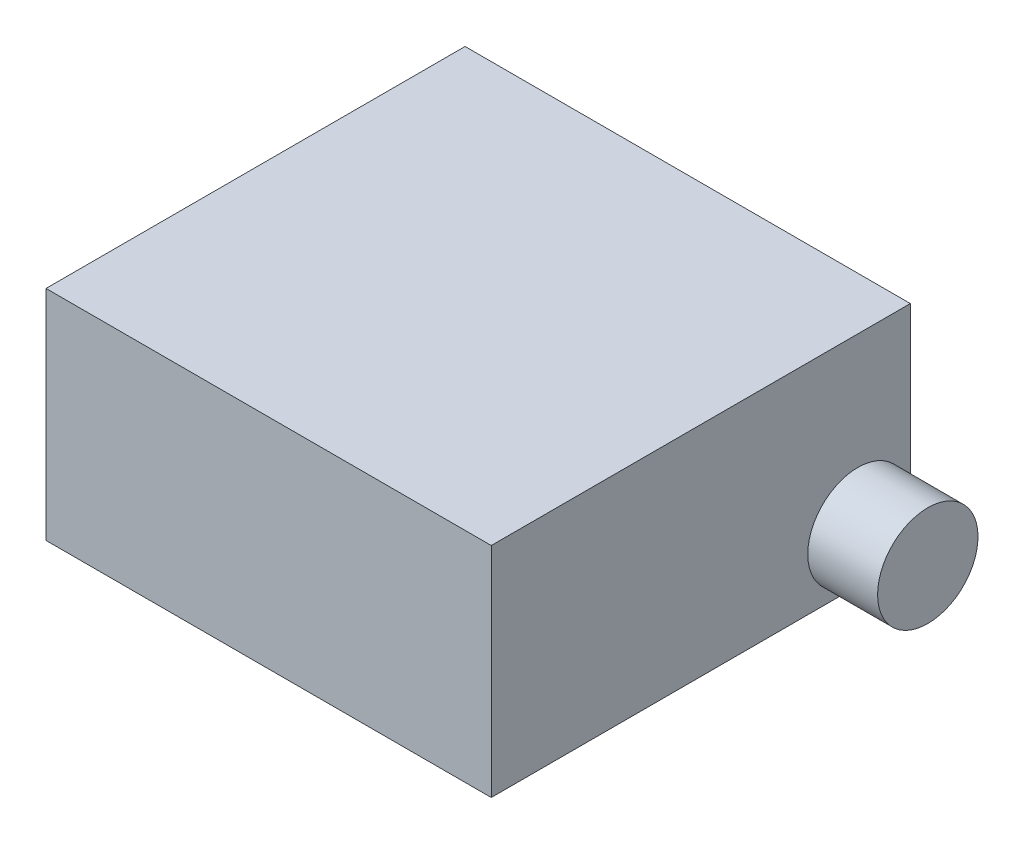
ISO-10303-21;
HEADER;
FILE_DESCRIPTION(('STEP AP214'),'2;1');
FILE_NAME('part.step','',(''),(''),'','','');
FILE_SCHEMA(('AUTOMOTIVE_DESIGN { 1 0 10303 214 1 1 1 1 }'));
ENDSEC;
DATA;
#1=APPLICATION_CONTEXT('core data for automotive mechanical design processes');
#2=APPLICATION_PROTOCOL_DEFINITION('international standard','automotive_design',2000,#1);
#3=PRODUCT_CONTEXT('',#1,'mechanical');
#4=PRODUCT('Part','Part','',(#3));
#5=PRODUCT_RELATED_PRODUCT_CATEGORY('part','',(#4));
#6=PRODUCT_DEFINITION_FORMATION('','',#4);
#7=PRODUCT_DEFINITION_CONTEXT('part definition',#1,'design');
#8=PRODUCT_DEFINITION('design','',#6,#7);
#9=PRODUCT_DEFINITION_SHAPE('','',#8);
#10=(LENGTH_UNIT() NAMED_UNIT(*) SI_UNIT(.MILLI.,.METRE.));
#11=(NAMED_UNIT(*) PLANE_ANGLE_UNIT() SI_UNIT($,.RADIAN.));
#12=(NAMED_UNIT(*) SI_UNIT($,.STERADIAN.) SOLID_ANGLE_UNIT());
#13=UNCERTAINTY_MEASURE_WITH_UNIT(LENGTH_MEASURE(1.E-05),#10,'distance_accuracy_value','');
#14=(GEOMETRIC_REPRESENTATION_CONTEXT(3) GLOBAL_UNCERTAINTY_ASSIGNED_CONTEXT((#13)) GLOBAL_UNIT_ASSIGNED_CONTEXT((#10,
#11,#12)) REPRESENTATION_CONTEXT('',''));
#15=CARTESIAN_POINT('',(0.,0.,0.));
#16=DIRECTION('',(0.,0.,1.));
#17=DIRECTION('',(1.,0.,0.));
#18=AXIS2_PLACEMENT_3D('',#15,#16,#17);
#19=CARTESIAN_POINT('',(0.,5.,0.));
#20=DIRECTION('',(1.,0.,0.));
#21=DIRECTION('',(0.,0.,-1.));
#22=AXIS2_PLACEMENT_3D('',#19,#20,#21);
#23=PLANE('',#22);
#24=DIRECTION('',(0.,0.,1.));
#25=VECTOR('',#24,1.);
#26=CARTESIAN_POINT('',(0.,0.,0.));
#27=LINE('',#26,#25);
#28=CARTESIAN_POINT('',(0.,0.,-9.6));
#29=VERTEX_POINT('',#28);
#30=CARTESIAN_POINT('',(0.,0.,0.));
#31=VERTEX_POINT('',#30);
#32=EDGE_CURVE('E100',#29,#31,#27,.T.);
#33=ORIENTED_EDGE('',*,*,#32,.T.);
#34=DIRECTION('',(0.,-1.,0.));
#35=VECTOR('',#34,1.);
#36=CARTESIAN_POINT('',(0.,5.,0.));
#37=LINE('',#36,#35);
#38=CARTESIAN_POINT('',(0.,5.,0.));
#39=VERTEX_POINT('',#38);
#40=EDGE_CURVE('E42',#39,#31,#37,.T.);
#41=ORIENTED_EDGE('',*,*,#40,.F.);
#42=DIRECTION('',(0.,0.,1.));
#43=VECTOR('',#42,1.);
#44=CARTESIAN_POINT('',(0.,5.,0.));
#45=LINE('',#44,#43);
#46=CARTESIAN_POINT('',(0.,5.,-9.6));
#47=VERTEX_POINT('',#46);
#48=EDGE_CURVE('E86',#47,#39,#45,.T.);
#49=ORIENTED_EDGE('',*,*,#48,.F.);
#50=DIRECTION('',(0.,-1.,0.));
#51=VECTOR('',#50,1.);
#52=CARTESIAN_POINT('',(0.,5.,-9.6));
#53=LINE('',#52,#51);
#54=EDGE_CURVE('E96',#47,#29,#53,.T.);
#55=ORIENTED_EDGE('',*,*,#54,.T.);
#56=EDGE_LOOP('',(#33,#41,#49,#55));
#57=FACE_BOUND('',#56,.T.);
#58=ADVANCED_FACE('F34',(#57),#23,.F.);
#59=CARTESIAN_POINT('',(0.,5.,0.));
#60=DIRECTION('',(0.,0.,-1.));
#61=DIRECTION('',(-1.,0.,0.));
#62=AXIS2_PLACEMENT_3D('',#59,#60,#61);
#63=PLANE('',#62);
#64=DIRECTION('',(1.,0.,0.));
#65=VECTOR('',#64,1.);
#66=CARTESIAN_POINT('',(0.,0.,0.));
#67=LINE('',#66,#65);
#68=CARTESIAN_POINT('',(10.2,0.,0.));
#69=VERTEX_POINT('',#68);
#70=EDGE_CURVE('E91',#31,#69,#67,.T.);
#71=ORIENTED_EDGE('',*,*,#70,.T.);
#72=DIRECTION('',(0.,-1.,0.));
#73=VECTOR('',#72,1.);
#74=CARTESIAN_POINT('',(10.2,5.,0.));
#75=LINE('',#74,#73);
#76=CARTESIAN_POINT('',(10.2,5.,0.));
#77=VERTEX_POINT('',#76);
#78=EDGE_CURVE('E89',#77,#69,#75,.T.);
#79=ORIENTED_EDGE('',*,*,#78,.F.);
#80=DIRECTION('',(1.,0.,0.));
#81=VECTOR('',#80,1.);
#82=CARTESIAN_POINT('',(0.,5.,0.));
#83=LINE('',#82,#81);
#84=EDGE_CURVE('E81',#39,#77,#83,.T.);
#85=ORIENTED_EDGE('',*,*,#84,.F.);
#86=ORIENTED_EDGE('',*,*,#40,.T.);
#87=EDGE_LOOP('',(#71,#79,#85,#86));
#88=FACE_BOUND('',#87,.T.);
#89=ADVANCED_FACE('F90',(#88),#63,.F.);
#90=CARTESIAN_POINT('',(10.2,5.,0.));
#91=DIRECTION('',(-1.,0.,0.));
#92=DIRECTION('',(0.,0.,1.));
#93=AXIS2_PLACEMENT_3D('',#90,#91,#92);
#94=PLANE('',#93);
#95=CARTESIAN_POINT('',(10.2,1.2,-8.4));
#96=DIRECTION('',(-1.,0.,0.));
#97=DIRECTION('',(0.,0.,1.));
#98=AXIS2_PLACEMENT_3D('',#95,#96,#97);
#99=CIRCLE('',#98,1.15);
#100=CARTESIAN_POINT('',(10.2,1.2,-7.25));
#101=VERTEX_POINT('',#100);
#102=EDGE_CURVE('E11',#101,#101,#99,.F.);
#103=ORIENTED_EDGE('',*,*,#102,.F.);
#104=EDGE_LOOP('',(#103));
#105=FACE_BOUND('',#104,.T.);
#106=DIRECTION('',(0.,0.,-1.));
#107=VECTOR('',#106,1.);
#108=CARTESIAN_POINT('',(10.2,0.,0.));
#109=LINE('',#108,#107);
#110=CARTESIAN_POINT('',(10.2,0.,-9.6));
#111=VERTEX_POINT('',#110);
#112=EDGE_CURVE('E67',#69,#111,#109,.T.);
#113=ORIENTED_EDGE('',*,*,#112,.T.);
#114=DIRECTION('',(0.,-1.,0.));
#115=VECTOR('',#114,1.);
#116=CARTESIAN_POINT('',(10.2,5.,-9.6));
#117=LINE('',#116,#115);
#118=CARTESIAN_POINT('',(10.2,5.,-9.6));
#119=VERTEX_POINT('',#118);
#120=EDGE_CURVE('E92',#119,#111,#117,.T.);
#121=ORIENTED_EDGE('',*,*,#120,.F.);
#122=DIRECTION('',(0.,0.,-1.));
#123=VECTOR('',#122,1.);
#124=CARTESIAN_POINT('',(10.2,5.,0.));
#125=LINE('',#124,#123);
#126=EDGE_CURVE('E84',#77,#119,#125,.T.);
#127=ORIENTED_EDGE('',*,*,#126,.F.);
#128=ORIENTED_EDGE('',*,*,#78,.T.);
#129=EDGE_LOOP('',(#113,#121,#127,#128));
#130=FACE_BOUND('',#129,.T.);
#131=ADVANCED_FACE('F94',(#105,#130),#94,.F.);
#132=CARTESIAN_POINT('',(0.,5.,-9.6));
#133=DIRECTION('',(0.,0.,1.));
#134=DIRECTION('',(1.,0.,0.));
#135=AXIS2_PLACEMENT_3D('',#132,#133,#134);
#136=PLANE('',#135);
#137=DIRECTION('',(-1.,0.,0.));
#138=VECTOR('',#137,1.);
#139=CARTESIAN_POINT('',(0.,0.,-9.6));
#140=LINE('',#139,#138);
#141=EDGE_CURVE('E73',#111,#29,#140,.T.);
#142=ORIENTED_EDGE('',*,*,#141,.T.);
#143=ORIENTED_EDGE('',*,*,#54,.F.);
#144=DIRECTION('',(-1.,0.,0.));
#145=VECTOR('',#144,1.);
#146=CARTESIAN_POINT('',(0.,5.,-9.6));
#147=LINE('',#146,#145);
#148=EDGE_CURVE('E50',#119,#47,#147,.T.);
#149=ORIENTED_EDGE('',*,*,#148,.F.);
#150=ORIENTED_EDGE('',*,*,#120,.T.);
#151=EDGE_LOOP('',(#142,#143,#149,#150));
#152=FACE_BOUND('',#151,.T.);
#153=ADVANCED_FACE('F122',(#152),#136,.F.);
#154=CARTESIAN_POINT('',(0.,5.,0.));
#155=DIRECTION('',(0.,-1.,0.));
#156=DIRECTION('',(0.,0.,-1.));
#157=AXIS2_PLACEMENT_3D('',#154,#155,#156);
#158=PLANE('',#157);
#159=ORIENTED_EDGE('',*,*,#48,.T.);
#160=ORIENTED_EDGE('',*,*,#84,.T.);
#161=ORIENTED_EDGE('',*,*,#126,.T.);
#162=ORIENTED_EDGE('',*,*,#148,.T.);
#163=EDGE_LOOP('',(#159,#160,#161,#162));
#164=FACE_BOUND('',#163,.T.);
#165=ADVANCED_FACE('F82',(#164),#158,.F.);
#166=CARTESIAN_POINT('',(0.,0.,0.));
#167=DIRECTION('',(0.,-1.,0.));
#168=DIRECTION('',(0.,0.,-1.));
#169=AXIS2_PLACEMENT_3D('',#166,#167,#168);
#170=PLANE('',#169);
#171=ORIENTED_EDGE('',*,*,#32,.F.);
#172=ORIENTED_EDGE('',*,*,#141,.F.);
#173=ORIENTED_EDGE('',*,*,#112,.F.);
#174=ORIENTED_EDGE('',*,*,#70,.F.);
#175=EDGE_LOOP('',(#171,#172,#173,#174));
#176=FACE_BOUND('',#175,.T.);
#177=ADVANCED_FACE('F111',(#176),#170,.T.);
#178=CARTESIAN_POINT('',(11.8,1.2,-8.4));
#179=DIRECTION('',(-1.,0.,0.));
#180=DIRECTION('',(0.,0.,1.));
#181=AXIS2_PLACEMENT_3D('',#178,#179,#180);
#182=CYLINDRICAL_SURFACE('',#181,1.15);
#183=CARTESIAN_POINT('',(11.8,1.2,-8.4));
#184=DIRECTION('',(1.,0.,0.));
#185=DIRECTION('',(0.,0.,-1.));
#186=AXIS2_PLACEMENT_3D('',#183,#184,#185);
#187=CIRCLE('',#186,1.15);
#188=CARTESIAN_POINT('',(11.8,1.2,-9.55));
#189=VERTEX_POINT('',#188);
#190=EDGE_CURVE('E103',#189,#189,#187,.T.);
#191=ORIENTED_EDGE('',*,*,#190,.F.);
#192=EDGE_LOOP('',(#191));
#193=FACE_BOUND('',#192,.T.);
#194=ORIENTED_EDGE('',*,*,#102,.T.);
#195=EDGE_LOOP('',(#194));
#196=FACE_BOUND('',#195,.T.);
#197=ADVANCED_FACE('F113',(#193,#196),#182,.T.);
#198=CARTESIAN_POINT('',(11.8,1.2,-8.4));
#199=DIRECTION('',(1.,0.,0.));
#200=DIRECTION('',(0.,0.,-1.));
#201=AXIS2_PLACEMENT_3D('',#198,#199,#200);
#202=PLANE('',#201);
#203=ORIENTED_EDGE('',*,*,#190,.T.);
#204=EDGE_LOOP('',(#203));
#205=FACE_BOUND('',#204,.T.);
#206=ADVANCED_FACE('F119',(#205),#202,.T.);
#207=CLOSED_SHELL('',(#58,#89,#131,#153,#165,#177,#197,#206));
#208=MANIFOLD_SOLID_BREP('B2',#207);
#209=ADVANCED_BREP_SHAPE_REPRESENTATION('',(#18,#208),#14);
#210=SHAPE_DEFINITION_REPRESENTATION(#9,#209);
ENDSEC;
END-ISO-10303-21;
